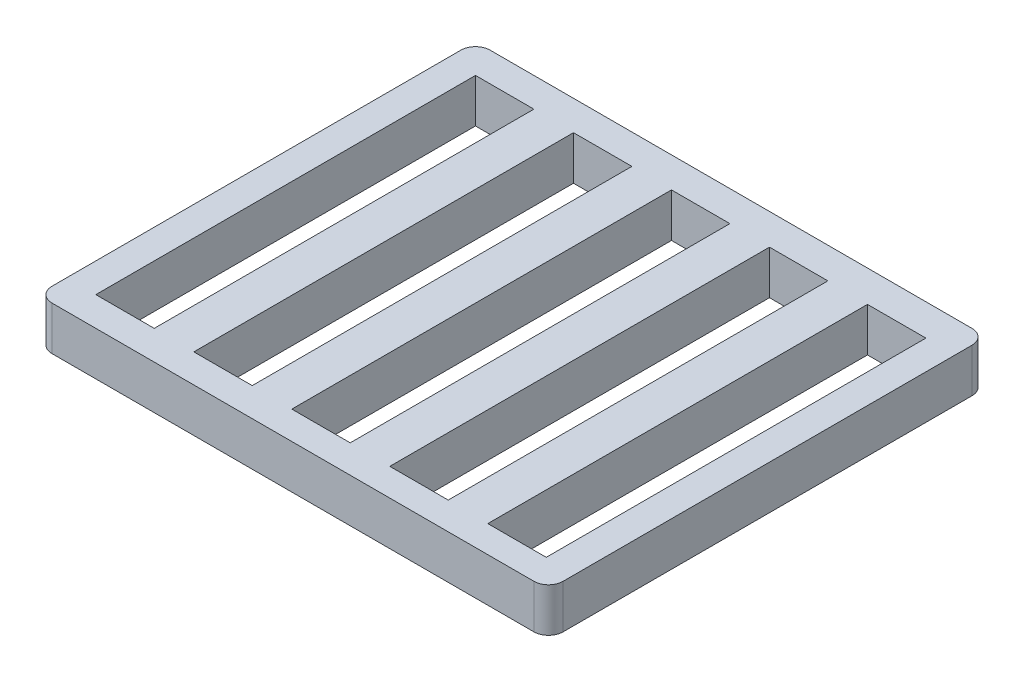
ISO-10303-21;
HEADER;
FILE_DESCRIPTION(('STEP AP214'),'2;1');
FILE_NAME('part.step','',(''),(''),'','','');
FILE_SCHEMA(('AUTOMOTIVE_DESIGN { 1 0 10303 214 1 1 1 1 }'));
ENDSEC;
DATA;
#1=APPLICATION_CONTEXT('core data for automotive mechanical design processes');
#2=APPLICATION_PROTOCOL_DEFINITION('international standard','automotive_design',2000,#1);
#3=PRODUCT_CONTEXT('',#1,'mechanical');
#4=PRODUCT('Part','Part','',(#3));
#5=PRODUCT_RELATED_PRODUCT_CATEGORY('part','',(#4));
#6=PRODUCT_DEFINITION_FORMATION('','',#4);
#7=PRODUCT_DEFINITION_CONTEXT('part definition',#1,'design');
#8=PRODUCT_DEFINITION('design','',#6,#7);
#9=PRODUCT_DEFINITION_SHAPE('','',#8);
#10=(LENGTH_UNIT() NAMED_UNIT(*) SI_UNIT(.MILLI.,.METRE.));
#11=(NAMED_UNIT(*) PLANE_ANGLE_UNIT() SI_UNIT($,.RADIAN.));
#12=(NAMED_UNIT(*) SI_UNIT($,.STERADIAN.) SOLID_ANGLE_UNIT());
#13=UNCERTAINTY_MEASURE_WITH_UNIT(LENGTH_MEASURE(1.E-05),#10,'distance_accuracy_value','');
#14=(GEOMETRIC_REPRESENTATION_CONTEXT(3) GLOBAL_UNCERTAINTY_ASSIGNED_CONTEXT((#13)) GLOBAL_UNIT_ASSIGNED_CONTEXT((#10,
#11,#12)) REPRESENTATION_CONTEXT('',''));
#15=CARTESIAN_POINT('',(0.,0.,0.));
#16=DIRECTION('',(0.,0.,1.));
#17=DIRECTION('',(1.,0.,0.));
#18=AXIS2_PLACEMENT_3D('',#15,#16,#17);
#19=CARTESIAN_POINT('',(0.,30.,300.));
#20=DIRECTION('',(0.,0.,-1.));
#21=DIRECTION('',(-1.,0.,0.));
#22=AXIS2_PLACEMENT_3D('',#19,#20,#21);
#23=PLANE('',#22);
#24=DIRECTION('',(1.,0.,0.));
#25=VECTOR('',#24,1.);
#26=CARTESIAN_POINT('',(0.,30.,300.));
#27=LINE('',#26,#25);
#28=CARTESIAN_POINT('',(10.,30.,300.));
#29=VERTEX_POINT('',#28);
#30=CARTESIAN_POINT('',(340.,30.,300.));
#31=VERTEX_POINT('',#30);
#32=EDGE_CURVE('E462',#29,#31,#27,.T.);
#33=ORIENTED_EDGE('',*,*,#32,.F.);
#34=DIRECTION('',(0.,-1.,0.));
#35=VECTOR('',#34,1.);
#36=CARTESIAN_POINT('',(10.,30.,300.));
#37=LINE('',#36,#35);
#38=CARTESIAN_POINT('',(10.,0.,300.));
#39=VERTEX_POINT('',#38);
#40=EDGE_CURVE('E531',#29,#39,#37,.T.);
#41=ORIENTED_EDGE('',*,*,#40,.T.);
#42=DIRECTION('',(1.,0.,0.));
#43=VECTOR('',#42,1.);
#44=CARTESIAN_POINT('',(0.,0.,300.));
#45=LINE('',#44,#43);
#46=CARTESIAN_POINT('',(340.,0.,300.));
#47=VERTEX_POINT('',#46);
#48=EDGE_CURVE('E281',#39,#47,#45,.T.);
#49=ORIENTED_EDGE('',*,*,#48,.T.);
#50=DIRECTION('',(0.,-1.,0.));
#51=VECTOR('',#50,1.);
#52=CARTESIAN_POINT('',(340.,30.,300.));
#53=LINE('',#52,#51);
#54=EDGE_CURVE('E528',#47,#31,#53,.F.);
#55=ORIENTED_EDGE('',*,*,#54,.T.);
#56=EDGE_LOOP('',(#33,#41,#49,#55));
#57=FACE_BOUND('',#56,.T.);
#58=ADVANCED_FACE('F43',(#57),#23,.F.);
#59=CARTESIAN_POINT('',(350.,30.,0.));
#60=DIRECTION('',(1.,0.,0.));
#61=DIRECTION('',(0.,0.,-1.));
#62=AXIS2_PLACEMENT_3D('',#59,#60,#61);
#63=PLANE('',#62);
#64=DIRECTION('',(0.,0.,1.));
#65=VECTOR('',#64,1.);
#66=CARTESIAN_POINT('',(350.,30.,0.));
#67=LINE('',#66,#65);
#68=CARTESIAN_POINT('',(350.,30.,10.));
#69=VERTEX_POINT('',#68);
#70=CARTESIAN_POINT('',(350.,30.,290.));
#71=VERTEX_POINT('',#70);
#72=EDGE_CURVE('E465',#69,#71,#67,.T.);
#73=ORIENTED_EDGE('',*,*,#72,.T.);
#74=DIRECTION('',(0.,-1.,0.));
#75=VECTOR('',#74,1.);
#76=CARTESIAN_POINT('',(350.,0.,290.));
#77=LINE('',#76,#75);
#78=CARTESIAN_POINT('',(350.,0.,290.));
#79=VERTEX_POINT('',#78);
#80=EDGE_CURVE('E11',#71,#79,#77,.T.);
#81=ORIENTED_EDGE('',*,*,#80,.T.);
#82=DIRECTION('',(0.,0.,1.));
#83=VECTOR('',#82,1.);
#84=CARTESIAN_POINT('',(350.,0.,0.));
#85=LINE('',#84,#83);
#86=CARTESIAN_POINT('',(350.,0.,10.));
#87=VERTEX_POINT('',#86);
#88=EDGE_CURVE('E481',#87,#79,#85,.T.);
#89=ORIENTED_EDGE('',*,*,#88,.F.);
#90=DIRECTION('',(0.,-1.,0.));
#91=VECTOR('',#90,1.);
#92=CARTESIAN_POINT('',(350.,30.,10.));
#93=LINE('',#92,#91);
#94=EDGE_CURVE('E52',#87,#69,#93,.F.);
#95=ORIENTED_EDGE('',*,*,#94,.T.);
#96=EDGE_LOOP('',(#73,#81,#89,#95));
#97=FACE_BOUND('',#96,.T.);
#98=ADVANCED_FACE('F548',(#97),#63,.T.);
#99=CARTESIAN_POINT('',(0.,30.,0.));
#100=DIRECTION('',(0.,0.,-1.));
#101=DIRECTION('',(-1.,0.,0.));
#102=AXIS2_PLACEMENT_3D('',#99,#100,#101);
#103=PLANE('',#102);
#104=DIRECTION('',(1.,0.,0.));
#105=VECTOR('',#104,1.);
#106=CARTESIAN_POINT('',(0.,0.,0.));
#107=LINE('',#106,#105);
#108=CARTESIAN_POINT('',(10.,0.,0.));
#109=VERTEX_POINT('',#108);
#110=CARTESIAN_POINT('',(340.,0.,0.));
#111=VERTEX_POINT('',#110);
#112=EDGE_CURVE('E485',#109,#111,#107,.T.);
#113=ORIENTED_EDGE('',*,*,#112,.F.);
#114=DIRECTION('',(0.,-1.,0.));
#115=VECTOR('',#114,1.);
#116=CARTESIAN_POINT('',(10.,30.,0.));
#117=LINE('',#116,#115);
#118=CARTESIAN_POINT('',(10.,30.,0.));
#119=VERTEX_POINT('',#118);
#120=EDGE_CURVE('E514',#109,#119,#117,.F.);
#121=ORIENTED_EDGE('',*,*,#120,.T.);
#122=DIRECTION('',(1.,0.,0.));
#123=VECTOR('',#122,1.);
#124=CARTESIAN_POINT('',(0.,30.,0.));
#125=LINE('',#124,#123);
#126=CARTESIAN_POINT('',(340.,30.,0.));
#127=VERTEX_POINT('',#126);
#128=EDGE_CURVE('E469',#119,#127,#125,.T.);
#129=ORIENTED_EDGE('',*,*,#128,.T.);
#130=DIRECTION('',(0.,-1.,0.));
#131=VECTOR('',#130,1.);
#132=CARTESIAN_POINT('',(340.,30.,0.));
#133=LINE('',#132,#131);
#134=EDGE_CURVE('E510',#127,#111,#133,.T.);
#135=ORIENTED_EDGE('',*,*,#134,.T.);
#136=EDGE_LOOP('',(#113,#121,#129,#135));
#137=FACE_BOUND('',#136,.T.);
#138=ADVANCED_FACE('F555',(#137),#103,.T.);
#139=CARTESIAN_POINT('',(0.,30.,0.));
#140=DIRECTION('',(1.,0.,0.));
#141=DIRECTION('',(0.,0.,-1.));
#142=AXIS2_PLACEMENT_3D('',#139,#140,#141);
#143=PLANE('',#142);
#144=DIRECTION('',(0.,0.,1.));
#145=VECTOR('',#144,1.);
#146=CARTESIAN_POINT('',(0.,30.,0.));
#147=LINE('',#146,#145);
#148=CARTESIAN_POINT('',(0.,30.,10.));
#149=VERTEX_POINT('',#148);
#150=CARTESIAN_POINT('',(0.,30.,290.));
#151=VERTEX_POINT('',#150);
#152=EDGE_CURVE('E473',#149,#151,#147,.T.);
#153=ORIENTED_EDGE('',*,*,#152,.F.);
#154=DIRECTION('',(0.,-1.,0.));
#155=VECTOR('',#154,1.);
#156=CARTESIAN_POINT('',(0.,0.,10.));
#157=LINE('',#156,#155);
#158=CARTESIAN_POINT('',(0.,0.,10.));
#159=VERTEX_POINT('',#158);
#160=EDGE_CURVE('E494',#149,#159,#157,.T.);
#161=ORIENTED_EDGE('',*,*,#160,.T.);
#162=DIRECTION('',(0.,0.,1.));
#163=VECTOR('',#162,1.);
#164=CARTESIAN_POINT('',(0.,0.,0.));
#165=LINE('',#164,#163);
#166=CARTESIAN_POINT('',(0.,0.,290.));
#167=VERTEX_POINT('',#166);
#168=EDGE_CURVE('E466',#159,#167,#165,.T.);
#169=ORIENTED_EDGE('',*,*,#168,.T.);
#170=DIRECTION('',(0.,-1.,0.));
#171=VECTOR('',#170,1.);
#172=CARTESIAN_POINT('',(0.,30.,290.));
#173=LINE('',#172,#171);
#174=EDGE_CURVE('E477',#167,#151,#173,.F.);
#175=ORIENTED_EDGE('',*,*,#174,.T.);
#176=EDGE_LOOP('',(#153,#161,#169,#175));
#177=FACE_BOUND('',#176,.T.);
#178=ADVANCED_FACE('F563',(#177),#143,.F.);
#179=CARTESIAN_POINT('',(0.,30.,0.));
#180=DIRECTION('',(0.,-1.,0.));
#181=DIRECTION('',(0.,0.,-1.));
#182=AXIS2_PLACEMENT_3D('',#179,#180,#181);
#183=PLANE('',#182);
#184=DIRECTION('',(1.,0.,0.));
#185=VECTOR('',#184,1.);
#186=CARTESIAN_POINT('',(60.,30.,20.));
#187=LINE('',#186,#185);
#188=CARTESIAN_POINT('',(20.,30.,20.));
#189=VERTEX_POINT('',#188);
#190=CARTESIAN_POINT('',(60.,30.,20.));
#191=VERTEX_POINT('',#190);
#192=EDGE_CURVE('E243',#189,#191,#187,.T.);
#193=ORIENTED_EDGE('',*,*,#192,.T.);
#194=DIRECTION('',(0.,0.,1.));
#195=VECTOR('',#194,1.);
#196=CARTESIAN_POINT('',(60.,30.,20.));
#197=LINE('',#196,#195);
#198=CARTESIAN_POINT('',(60.,30.,280.));
#199=VERTEX_POINT('',#198);
#200=EDGE_CURVE('E234',#191,#199,#197,.T.);
#201=ORIENTED_EDGE('',*,*,#200,.T.);
#202=DIRECTION('',(-1.,0.,0.));
#203=VECTOR('',#202,1.);
#204=CARTESIAN_POINT('',(60.,30.,280.));
#205=LINE('',#204,#203);
#206=CARTESIAN_POINT('',(20.,30.,280.));
#207=VERTEX_POINT('',#206);
#208=EDGE_CURVE('E247',#199,#207,#205,.T.);
#209=ORIENTED_EDGE('',*,*,#208,.T.);
#210=DIRECTION('',(0.,0.,-1.));
#211=VECTOR('',#210,1.);
#212=CARTESIAN_POINT('',(20.,30.,20.));
#213=LINE('',#212,#211);
#214=EDGE_CURVE('E252',#207,#189,#213,.T.);
#215=ORIENTED_EDGE('',*,*,#214,.T.);
#216=EDGE_LOOP('',(#193,#201,#209,#215));
#217=FACE_BOUND('',#216,.T.);
#218=DIRECTION('',(0.,0.,-1.));
#219=VECTOR('',#218,1.);
#220=CARTESIAN_POINT('',(87.5,30.,20.3913207061418));
#221=LINE('',#220,#219);
#222=CARTESIAN_POINT('',(87.5,30.,280.391320706142));
#223=VERTEX_POINT('',#222);
#224=CARTESIAN_POINT('',(87.5,30.,20.3913207061418));
#225=VERTEX_POINT('',#224);
#226=EDGE_CURVE('E291',#223,#225,#221,.T.);
#227=ORIENTED_EDGE('',*,*,#226,.T.);
#228=DIRECTION('',(1.,0.,0.));
#229=VECTOR('',#228,1.);
#230=CARTESIAN_POINT('',(127.5,30.,20.3913207061418));
#231=LINE('',#230,#229);
#232=CARTESIAN_POINT('',(127.5,30.,20.3913207061418));
#233=VERTEX_POINT('',#232);
#234=EDGE_CURVE('E307',#225,#233,#231,.T.);
#235=ORIENTED_EDGE('',*,*,#234,.T.);
#236=DIRECTION('',(0.,0.,1.));
#237=VECTOR('',#236,1.);
#238=CARTESIAN_POINT('',(127.5,30.,20.3913207061418));
#239=LINE('',#238,#237);
#240=CARTESIAN_POINT('',(127.5,30.,280.391320706142));
#241=VERTEX_POINT('',#240);
#242=EDGE_CURVE('E324',#233,#241,#239,.T.);
#243=ORIENTED_EDGE('',*,*,#242,.T.);
#244=DIRECTION('',(-1.,0.,0.));
#245=VECTOR('',#244,1.);
#246=CARTESIAN_POINT('',(127.5,30.,280.391320706142));
#247=LINE('',#246,#245);
#248=EDGE_CURVE('E320',#241,#223,#247,.T.);
#249=ORIENTED_EDGE('',*,*,#248,.T.);
#250=EDGE_LOOP('',(#227,#235,#243,#249));
#251=FACE_BOUND('',#250,.T.);
#252=DIRECTION('',(0.,0.,-1.));
#253=VECTOR('',#252,1.);
#254=CARTESIAN_POINT('',(155.,30.,20.7826414122837));
#255=LINE('',#254,#253);
#256=CARTESIAN_POINT('',(155.,30.,280.782641412284));
#257=VERTEX_POINT('',#256);
#258=CARTESIAN_POINT('',(155.,30.,20.7826414122837));
#259=VERTEX_POINT('',#258);
#260=EDGE_CURVE('E335',#257,#259,#255,.T.);
#261=ORIENTED_EDGE('',*,*,#260,.T.);
#262=DIRECTION('',(1.,0.,0.));
#263=VECTOR('',#262,1.);
#264=CARTESIAN_POINT('',(195.,30.,20.7826414122837));
#265=LINE('',#264,#263);
#266=CARTESIAN_POINT('',(195.,30.,20.7826414122837));
#267=VERTEX_POINT('',#266);
#268=EDGE_CURVE('E351',#259,#267,#265,.T.);
#269=ORIENTED_EDGE('',*,*,#268,.T.);
#270=DIRECTION('',(0.,0.,1.));
#271=VECTOR('',#270,1.);
#272=CARTESIAN_POINT('',(195.,30.,20.7826414122837));
#273=LINE('',#272,#271);
#274=CARTESIAN_POINT('',(195.,30.,280.782641412284));
#275=VERTEX_POINT('',#274);
#276=EDGE_CURVE('E368',#267,#275,#273,.T.);
#277=ORIENTED_EDGE('',*,*,#276,.T.);
#278=DIRECTION('',(-1.,0.,0.));
#279=VECTOR('',#278,1.);
#280=CARTESIAN_POINT('',(195.,30.,280.782641412284));
#281=LINE('',#280,#279);
#282=EDGE_CURVE('E364',#275,#257,#281,.T.);
#283=ORIENTED_EDGE('',*,*,#282,.T.);
#284=EDGE_LOOP('',(#261,#269,#277,#283));
#285=FACE_BOUND('',#284,.T.);
#286=DIRECTION('',(0.,0.,-1.));
#287=VECTOR('',#286,1.);
#288=CARTESIAN_POINT('',(222.5,30.,21.1739621184255));
#289=LINE('',#288,#287);
#290=CARTESIAN_POINT('',(222.5,30.,281.173962118425));
#291=VERTEX_POINT('',#290);
#292=CARTESIAN_POINT('',(222.5,30.,21.1739621184255));
#293=VERTEX_POINT('',#292);
#294=EDGE_CURVE('E379',#291,#293,#289,.T.);
#295=ORIENTED_EDGE('',*,*,#294,.T.);
#296=DIRECTION('',(1.,0.,0.));
#297=VECTOR('',#296,1.);
#298=CARTESIAN_POINT('',(262.5,30.,21.1739621184255));
#299=LINE('',#298,#297);
#300=CARTESIAN_POINT('',(262.5,30.,21.1739621184255));
#301=VERTEX_POINT('',#300);
#302=EDGE_CURVE('E395',#293,#301,#299,.T.);
#303=ORIENTED_EDGE('',*,*,#302,.T.);
#304=DIRECTION('',(0.,0.,1.));
#305=VECTOR('',#304,1.);
#306=CARTESIAN_POINT('',(262.5,30.,21.1739621184255));
#307=LINE('',#306,#305);
#308=CARTESIAN_POINT('',(262.5,30.,281.173962118425));
#309=VERTEX_POINT('',#308);
#310=EDGE_CURVE('E412',#301,#309,#307,.T.);
#311=ORIENTED_EDGE('',*,*,#310,.T.);
#312=DIRECTION('',(-1.,0.,0.));
#313=VECTOR('',#312,1.);
#314=CARTESIAN_POINT('',(262.5,30.,281.173962118425));
#315=LINE('',#314,#313);
#316=EDGE_CURVE('E408',#309,#291,#315,.T.);
#317=ORIENTED_EDGE('',*,*,#316,.T.);
#318=EDGE_LOOP('',(#295,#303,#311,#317));
#319=FACE_BOUND('',#318,.T.);
#320=DIRECTION('',(0.,0.,-1.));
#321=VECTOR('',#320,1.);
#322=CARTESIAN_POINT('',(290.,30.,21.5652828245673));
#323=LINE('',#322,#321);
#324=CARTESIAN_POINT('',(290.,30.,281.565282824567));
#325=VERTEX_POINT('',#324);
#326=CARTESIAN_POINT('',(290.,30.,21.5652828245673));
#327=VERTEX_POINT('',#326);
#328=EDGE_CURVE('E423',#325,#327,#323,.T.);
#329=ORIENTED_EDGE('',*,*,#328,.T.);
#330=DIRECTION('',(1.,0.,0.));
#331=VECTOR('',#330,1.);
#332=CARTESIAN_POINT('',(330.,30.,21.5652828245673));
#333=LINE('',#332,#331);
#334=CARTESIAN_POINT('',(330.,30.,21.5652828245673));
#335=VERTEX_POINT('',#334);
#336=EDGE_CURVE('E438',#327,#335,#333,.T.);
#337=ORIENTED_EDGE('',*,*,#336,.T.);
#338=DIRECTION('',(0.,0.,1.));
#339=VECTOR('',#338,1.);
#340=CARTESIAN_POINT('',(330.,30.,21.5652828245673));
#341=LINE('',#340,#339);
#342=CARTESIAN_POINT('',(330.,30.,281.565282824567));
#343=VERTEX_POINT('',#342);
#344=EDGE_CURVE('E455',#335,#343,#341,.T.);
#345=ORIENTED_EDGE('',*,*,#344,.T.);
#346=DIRECTION('',(-1.,0.,0.));
#347=VECTOR('',#346,1.);
#348=CARTESIAN_POINT('',(330.,30.,281.565282824567));
#349=LINE('',#348,#347);
#350=EDGE_CURVE('E451',#343,#325,#349,.T.);
#351=ORIENTED_EDGE('',*,*,#350,.T.);
#352=EDGE_LOOP('',(#329,#337,#345,#351));
#353=FACE_BOUND('',#352,.T.);
#354=ORIENTED_EDGE('',*,*,#128,.F.);
#355=CARTESIAN_POINT('',(10.,30.,10.));
#356=DIRECTION('',(0.,-1.,0.));
#357=DIRECTION('',(0.,0.,-1.));
#358=AXIS2_PLACEMENT_3D('',#355,#356,#357);
#359=CIRCLE('',#358,10.);
#360=EDGE_CURVE('E525',#119,#149,#359,.F.);
#361=ORIENTED_EDGE('',*,*,#360,.T.);
#362=ORIENTED_EDGE('',*,*,#152,.T.);
#363=CARTESIAN_POINT('',(10.,30.,290.));
#364=DIRECTION('',(0.,-1.,0.));
#365=DIRECTION('',(0.,0.,-1.));
#366=AXIS2_PLACEMENT_3D('',#363,#364,#365);
#367=CIRCLE('',#366,10.);
#368=EDGE_CURVE('E522',#151,#29,#367,.F.);
#369=ORIENTED_EDGE('',*,*,#368,.T.);
#370=ORIENTED_EDGE('',*,*,#32,.T.);
#371=CARTESIAN_POINT('',(340.,30.,290.));
#372=DIRECTION('',(0.,-1.,0.));
#373=DIRECTION('',(0.,0.,-1.));
#374=AXIS2_PLACEMENT_3D('',#371,#372,#373);
#375=CIRCLE('',#374,10.);
#376=EDGE_CURVE('E59',#31,#71,#375,.F.);
#377=ORIENTED_EDGE('',*,*,#376,.T.);
#378=ORIENTED_EDGE('',*,*,#72,.F.);
#379=CARTESIAN_POINT('',(340.,30.,10.));
#380=DIRECTION('',(0.,-1.,0.));
#381=DIRECTION('',(0.,0.,-1.));
#382=AXIS2_PLACEMENT_3D('',#379,#380,#381);
#383=CIRCLE('',#382,10.);
#384=EDGE_CURVE('E517',#69,#127,#383,.F.);
#385=ORIENTED_EDGE('',*,*,#384,.T.);
#386=EDGE_LOOP('',(#354,#361,#362,#369,#370,#377,#378,#385));
#387=FACE_BOUND('',#386,.T.);
#388=ADVANCED_FACE('F254',(#217,#251,#285,#319,#353,#387),#183,.F.);
#389=CARTESIAN_POINT('',(0.,0.,0.));
#390=DIRECTION('',(0.,-1.,0.));
#391=DIRECTION('',(0.,0.,-1.));
#392=AXIS2_PLACEMENT_3D('',#389,#390,#391);
#393=PLANE('',#392);
#394=DIRECTION('',(0.,0.,1.));
#395=VECTOR('',#394,1.);
#396=CARTESIAN_POINT('',(60.,0.,20.));
#397=LINE('',#396,#395);
#398=CARTESIAN_POINT('',(60.,0.,20.));
#399=VERTEX_POINT('',#398);
#400=CARTESIAN_POINT('',(60.,0.,280.));
#401=VERTEX_POINT('',#400);
#402=EDGE_CURVE('E237',#399,#401,#397,.T.);
#403=ORIENTED_EDGE('',*,*,#402,.F.);
#404=DIRECTION('',(1.,0.,0.));
#405=VECTOR('',#404,1.);
#406=CARTESIAN_POINT('',(60.,0.,20.));
#407=LINE('',#406,#405);
#408=CARTESIAN_POINT('',(20.,0.,20.));
#409=VERTEX_POINT('',#408);
#410=EDGE_CURVE('E258',#409,#399,#407,.T.);
#411=ORIENTED_EDGE('',*,*,#410,.F.);
#412=DIRECTION('',(0.,0.,-1.));
#413=VECTOR('',#412,1.);
#414=CARTESIAN_POINT('',(20.,0.,20.));
#415=LINE('',#414,#413);
#416=CARTESIAN_POINT('',(20.,0.,280.));
#417=VERTEX_POINT('',#416);
#418=EDGE_CURVE('E262',#417,#409,#415,.T.);
#419=ORIENTED_EDGE('',*,*,#418,.F.);
#420=DIRECTION('',(-1.,0.,0.));
#421=VECTOR('',#420,1.);
#422=CARTESIAN_POINT('',(60.,0.,280.));
#423=LINE('',#422,#421);
#424=EDGE_CURVE('E271',#401,#417,#423,.T.);
#425=ORIENTED_EDGE('',*,*,#424,.F.);
#426=EDGE_LOOP('',(#403,#411,#419,#425));
#427=FACE_BOUND('',#426,.T.);
#428=DIRECTION('',(1.,0.,0.));
#429=VECTOR('',#428,1.);
#430=CARTESIAN_POINT('',(127.5,0.,20.3913207061418));
#431=LINE('',#430,#429);
#432=CARTESIAN_POINT('',(87.5,0.,20.3913207061418));
#433=VERTEX_POINT('',#432);
#434=CARTESIAN_POINT('',(127.5,0.,20.3913207061418));
#435=VERTEX_POINT('',#434);
#436=EDGE_CURVE('E272',#433,#435,#431,.T.);
#437=ORIENTED_EDGE('',*,*,#436,.F.);
#438=DIRECTION('',(0.,0.,-1.));
#439=VECTOR('',#438,1.);
#440=CARTESIAN_POINT('',(87.5,0.,20.3913207061418));
#441=LINE('',#440,#439);
#442=CARTESIAN_POINT('',(87.5,0.,280.391320706142));
#443=VERTEX_POINT('',#442);
#444=EDGE_CURVE('E302',#443,#433,#441,.T.);
#445=ORIENTED_EDGE('',*,*,#444,.F.);
#446=DIRECTION('',(-1.,0.,0.));
#447=VECTOR('',#446,1.);
#448=CARTESIAN_POINT('',(127.5,0.,280.391320706142));
#449=LINE('',#448,#447);
#450=CARTESIAN_POINT('',(127.5,0.,280.391320706142));
#451=VERTEX_POINT('',#450);
#452=EDGE_CURVE('E306',#451,#443,#449,.T.);
#453=ORIENTED_EDGE('',*,*,#452,.F.);
#454=DIRECTION('',(0.,0.,1.));
#455=VECTOR('',#454,1.);
#456=CARTESIAN_POINT('',(127.5,0.,20.3913207061418));
#457=LINE('',#456,#455);
#458=EDGE_CURVE('E311',#435,#451,#457,.T.);
#459=ORIENTED_EDGE('',*,*,#458,.F.);
#460=EDGE_LOOP('',(#437,#445,#453,#459));
#461=FACE_BOUND('',#460,.T.);
#462=DIRECTION('',(1.,0.,0.));
#463=VECTOR('',#462,1.);
#464=CARTESIAN_POINT('',(195.,0.,20.7826414122837));
#465=LINE('',#464,#463);
#466=CARTESIAN_POINT('',(155.,0.,20.7826414122837));
#467=VERTEX_POINT('',#466);
#468=CARTESIAN_POINT('',(195.,0.,20.7826414122837));
#469=VERTEX_POINT('',#468);
#470=EDGE_CURVE('E301',#467,#469,#465,.T.);
#471=ORIENTED_EDGE('',*,*,#470,.F.);
#472=DIRECTION('',(0.,0.,-1.));
#473=VECTOR('',#472,1.);
#474=CARTESIAN_POINT('',(155.,0.,20.7826414122837));
#475=LINE('',#474,#473);
#476=CARTESIAN_POINT('',(155.,0.,280.782641412284));
#477=VERTEX_POINT('',#476);
#478=EDGE_CURVE('E346',#477,#467,#475,.T.);
#479=ORIENTED_EDGE('',*,*,#478,.F.);
#480=DIRECTION('',(-1.,0.,0.));
#481=VECTOR('',#480,1.);
#482=CARTESIAN_POINT('',(195.,0.,280.782641412284));
#483=LINE('',#482,#481);
#484=CARTESIAN_POINT('',(195.,0.,280.782641412284));
#485=VERTEX_POINT('',#484);
#486=EDGE_CURVE('E350',#485,#477,#483,.T.);
#487=ORIENTED_EDGE('',*,*,#486,.F.);
#488=DIRECTION('',(0.,0.,1.));
#489=VECTOR('',#488,1.);
#490=CARTESIAN_POINT('',(195.,0.,20.7826414122837));
#491=LINE('',#490,#489);
#492=EDGE_CURVE('E355',#469,#485,#491,.T.);
#493=ORIENTED_EDGE('',*,*,#492,.F.);
#494=EDGE_LOOP('',(#471,#479,#487,#493));
#495=FACE_BOUND('',#494,.T.);
#496=DIRECTION('',(1.,0.,0.));
#497=VECTOR('',#496,1.);
#498=CARTESIAN_POINT('',(262.5,0.,21.1739621184255));
#499=LINE('',#498,#497);
#500=CARTESIAN_POINT('',(222.5,0.,21.1739621184255));
#501=VERTEX_POINT('',#500);
#502=CARTESIAN_POINT('',(262.5,0.,21.1739621184255));
#503=VERTEX_POINT('',#502);
#504=EDGE_CURVE('E345',#501,#503,#499,.T.);
#505=ORIENTED_EDGE('',*,*,#504,.F.);
#506=DIRECTION('',(0.,0.,-1.));
#507=VECTOR('',#506,1.);
#508=CARTESIAN_POINT('',(222.5,0.,21.1739621184255));
#509=LINE('',#508,#507);
#510=CARTESIAN_POINT('',(222.5,0.,281.173962118425));
#511=VERTEX_POINT('',#510);
#512=EDGE_CURVE('E390',#511,#501,#509,.T.);
#513=ORIENTED_EDGE('',*,*,#512,.F.);
#514=DIRECTION('',(-1.,0.,0.));
#515=VECTOR('',#514,1.);
#516=CARTESIAN_POINT('',(262.5,0.,281.173962118425));
#517=LINE('',#516,#515);
#518=CARTESIAN_POINT('',(262.5,0.,281.173962118425));
#519=VERTEX_POINT('',#518);
#520=EDGE_CURVE('E394',#519,#511,#517,.T.);
#521=ORIENTED_EDGE('',*,*,#520,.F.);
#522=DIRECTION('',(0.,0.,1.));
#523=VECTOR('',#522,1.);
#524=CARTESIAN_POINT('',(262.5,0.,21.1739621184255));
#525=LINE('',#524,#523);
#526=EDGE_CURVE('E399',#503,#519,#525,.T.);
#527=ORIENTED_EDGE('',*,*,#526,.F.);
#528=EDGE_LOOP('',(#505,#513,#521,#527));
#529=FACE_BOUND('',#528,.T.);
#530=DIRECTION('',(1.,0.,0.));
#531=VECTOR('',#530,1.);
#532=CARTESIAN_POINT('',(330.,0.,21.5652828245673));
#533=LINE('',#532,#531);
#534=CARTESIAN_POINT('',(290.,0.,21.5652828245673));
#535=VERTEX_POINT('',#534);
#536=CARTESIAN_POINT('',(330.,0.,21.5652828245673));
#537=VERTEX_POINT('',#536);
#538=EDGE_CURVE('E389',#535,#537,#533,.T.);
#539=ORIENTED_EDGE('',*,*,#538,.F.);
#540=DIRECTION('',(0.,0.,-1.));
#541=VECTOR('',#540,1.);
#542=CARTESIAN_POINT('',(290.,0.,21.5652828245673));
#543=LINE('',#542,#541);
#544=CARTESIAN_POINT('',(290.,0.,281.565282824567));
#545=VERTEX_POINT('',#544);
#546=EDGE_CURVE('E433',#545,#535,#543,.T.);
#547=ORIENTED_EDGE('',*,*,#546,.F.);
#548=DIRECTION('',(-1.,0.,0.));
#549=VECTOR('',#548,1.);
#550=CARTESIAN_POINT('',(330.,0.,281.565282824567));
#551=LINE('',#550,#549);
#552=CARTESIAN_POINT('',(330.,0.,281.565282824567));
#553=VERTEX_POINT('',#552);
#554=EDGE_CURVE('E437',#553,#545,#551,.T.);
#555=ORIENTED_EDGE('',*,*,#554,.F.);
#556=DIRECTION('',(0.,0.,1.));
#557=VECTOR('',#556,1.);
#558=CARTESIAN_POINT('',(330.,0.,21.5652828245673));
#559=LINE('',#558,#557);
#560=EDGE_CURVE('E442',#537,#553,#559,.T.);
#561=ORIENTED_EDGE('',*,*,#560,.F.);
#562=EDGE_LOOP('',(#539,#547,#555,#561));
#563=FACE_BOUND('',#562,.T.);
#564=ORIENTED_EDGE('',*,*,#168,.F.);
#565=CARTESIAN_POINT('',(10.,0.,10.));
#566=DIRECTION('',(0.,-1.,0.));
#567=DIRECTION('',(0.,0.,-1.));
#568=AXIS2_PLACEMENT_3D('',#565,#566,#567);
#569=CIRCLE('',#568,10.);
#570=EDGE_CURVE('E507',#159,#109,#569,.T.);
#571=ORIENTED_EDGE('',*,*,#570,.T.);
#572=ORIENTED_EDGE('',*,*,#112,.T.);
#573=CARTESIAN_POINT('',(340.,0.,10.));
#574=DIRECTION('',(0.,-1.,0.));
#575=DIRECTION('',(0.,0.,-1.));
#576=AXIS2_PLACEMENT_3D('',#573,#574,#575);
#577=CIRCLE('',#576,10.);
#578=EDGE_CURVE('E498',#111,#87,#577,.T.);
#579=ORIENTED_EDGE('',*,*,#578,.T.);
#580=ORIENTED_EDGE('',*,*,#88,.T.);
#581=CARTESIAN_POINT('',(340.,0.,290.));
#582=DIRECTION('',(0.,-1.,0.));
#583=DIRECTION('',(0.,0.,-1.));
#584=AXIS2_PLACEMENT_3D('',#581,#582,#583);
#585=CIRCLE('',#584,10.);
#586=EDGE_CURVE('E501',#79,#47,#585,.T.);
#587=ORIENTED_EDGE('',*,*,#586,.T.);
#588=ORIENTED_EDGE('',*,*,#48,.F.);
#589=CARTESIAN_POINT('',(10.,0.,290.));
#590=DIRECTION('',(0.,-1.,0.));
#591=DIRECTION('',(0.,0.,-1.));
#592=AXIS2_PLACEMENT_3D('',#589,#590,#591);
#593=CIRCLE('',#592,10.);
#594=EDGE_CURVE('E504',#39,#167,#593,.T.);
#595=ORIENTED_EDGE('',*,*,#594,.T.);
#596=EDGE_LOOP('',(#564,#571,#572,#579,#580,#587,#588,#595));
#597=FACE_BOUND('',#596,.T.);
#598=ADVANCED_FACE('F544',(#427,#461,#495,#529,#563,#597),#393,.T.);
#599=CARTESIAN_POINT('',(330.,30.,21.5652828245673));
#600=DIRECTION('',(0.,0.,-1.));
#601=DIRECTION('',(-1.,0.,0.));
#602=AXIS2_PLACEMENT_3D('',#599,#600,#601);
#603=PLANE('',#602);
#604=ORIENTED_EDGE('',*,*,#538,.T.);
#605=DIRECTION('',(0.,-1.,0.));
#606=VECTOR('',#605,1.);
#607=CARTESIAN_POINT('',(330.,30.,21.5652828245673));
#608=LINE('',#607,#606);
#609=EDGE_CURVE('E419',#335,#537,#608,.T.);
#610=ORIENTED_EDGE('',*,*,#609,.F.);
#611=ORIENTED_EDGE('',*,*,#336,.F.);
#612=DIRECTION('',(0.,-1.,0.));
#613=VECTOR('',#612,1.);
#614=CARTESIAN_POINT('',(290.,30.,21.5652828245673));
#615=LINE('',#614,#613);
#616=EDGE_CURVE('E430',#327,#535,#615,.T.);
#617=ORIENTED_EDGE('',*,*,#616,.T.);
#618=EDGE_LOOP('',(#604,#610,#611,#617));
#619=FACE_BOUND('',#618,.T.);
#620=ADVANCED_FACE('F586',(#619),#603,.F.);
#621=CARTESIAN_POINT('',(290.,30.,21.5652828245673));
#622=DIRECTION('',(-1.,0.,0.));
#623=DIRECTION('',(0.,0.,1.));
#624=AXIS2_PLACEMENT_3D('',#621,#622,#623);
#625=PLANE('',#624);
#626=ORIENTED_EDGE('',*,*,#546,.T.);
#627=ORIENTED_EDGE('',*,*,#616,.F.);
#628=ORIENTED_EDGE('',*,*,#328,.F.);
#629=DIRECTION('',(0.,-1.,0.));
#630=VECTOR('',#629,1.);
#631=CARTESIAN_POINT('',(290.,30.,281.565282824567));
#632=LINE('',#631,#630);
#633=EDGE_CURVE('E427',#325,#545,#632,.T.);
#634=ORIENTED_EDGE('',*,*,#633,.T.);
#635=EDGE_LOOP('',(#626,#627,#628,#634));
#636=FACE_BOUND('',#635,.T.);
#637=ADVANCED_FACE('F590',(#636),#625,.F.);
#638=CARTESIAN_POINT('',(330.,30.,281.565282824567));
#639=DIRECTION('',(0.,0.,1.));
#640=DIRECTION('',(1.,0.,0.));
#641=AXIS2_PLACEMENT_3D('',#638,#639,#640);
#642=PLANE('',#641);
#643=ORIENTED_EDGE('',*,*,#554,.T.);
#644=ORIENTED_EDGE('',*,*,#633,.F.);
#645=ORIENTED_EDGE('',*,*,#350,.F.);
#646=DIRECTION('',(0.,-1.,0.));
#647=VECTOR('',#646,1.);
#648=CARTESIAN_POINT('',(330.,30.,281.565282824567));
#649=LINE('',#648,#647);
#650=EDGE_CURVE('E424',#343,#553,#649,.T.);
#651=ORIENTED_EDGE('',*,*,#650,.T.);
#652=EDGE_LOOP('',(#643,#644,#645,#651));
#653=FACE_BOUND('',#652,.T.);
#654=ADVANCED_FACE('F593',(#653),#642,.F.);
#655=CARTESIAN_POINT('',(330.,30.,21.5652828245673));
#656=DIRECTION('',(1.,0.,0.));
#657=DIRECTION('',(0.,0.,-1.));
#658=AXIS2_PLACEMENT_3D('',#655,#656,#657);
#659=PLANE('',#658);
#660=ORIENTED_EDGE('',*,*,#560,.T.);
#661=ORIENTED_EDGE('',*,*,#650,.F.);
#662=ORIENTED_EDGE('',*,*,#344,.F.);
#663=ORIENTED_EDGE('',*,*,#609,.T.);
#664=EDGE_LOOP('',(#660,#661,#662,#663));
#665=FACE_BOUND('',#664,.T.);
#666=ADVANCED_FACE('F597',(#665),#659,.F.);
#667=CARTESIAN_POINT('',(262.5,30.,21.1739621184255));
#668=DIRECTION('',(0.,0.,-1.));
#669=DIRECTION('',(-1.,0.,0.));
#670=AXIS2_PLACEMENT_3D('',#667,#668,#669);
#671=PLANE('',#670);
#672=ORIENTED_EDGE('',*,*,#504,.T.);
#673=DIRECTION('',(0.,-1.,0.));
#674=VECTOR('',#673,1.);
#675=CARTESIAN_POINT('',(262.5,30.,21.1739621184255));
#676=LINE('',#675,#674);
#677=EDGE_CURVE('E375',#301,#503,#676,.T.);
#678=ORIENTED_EDGE('',*,*,#677,.F.);
#679=ORIENTED_EDGE('',*,*,#302,.F.);
#680=DIRECTION('',(0.,-1.,0.));
#681=VECTOR('',#680,1.);
#682=CARTESIAN_POINT('',(222.5,30.,21.1739621184255));
#683=LINE('',#682,#681);
#684=EDGE_CURVE('E386',#293,#501,#683,.T.);
#685=ORIENTED_EDGE('',*,*,#684,.T.);
#686=EDGE_LOOP('',(#672,#678,#679,#685));
#687=FACE_BOUND('',#686,.T.);
#688=ADVANCED_FACE('F601',(#687),#671,.F.);
#689=CARTESIAN_POINT('',(222.5,30.,21.1739621184255));
#690=DIRECTION('',(-1.,0.,0.));
#691=DIRECTION('',(0.,0.,1.));
#692=AXIS2_PLACEMENT_3D('',#689,#690,#691);
#693=PLANE('',#692);
#694=ORIENTED_EDGE('',*,*,#512,.T.);
#695=ORIENTED_EDGE('',*,*,#684,.F.);
#696=ORIENTED_EDGE('',*,*,#294,.F.);
#697=DIRECTION('',(0.,-1.,0.));
#698=VECTOR('',#697,1.);
#699=CARTESIAN_POINT('',(222.5,30.,281.173962118425));
#700=LINE('',#699,#698);
#701=EDGE_CURVE('E383',#291,#511,#700,.T.);
#702=ORIENTED_EDGE('',*,*,#701,.T.);
#703=EDGE_LOOP('',(#694,#695,#696,#702));
#704=FACE_BOUND('',#703,.T.);
#705=ADVANCED_FACE('F606',(#704),#693,.F.);
#706=CARTESIAN_POINT('',(262.5,30.,281.173962118425));
#707=DIRECTION('',(0.,0.,1.));
#708=DIRECTION('',(1.,0.,0.));
#709=AXIS2_PLACEMENT_3D('',#706,#707,#708);
#710=PLANE('',#709);
#711=ORIENTED_EDGE('',*,*,#520,.T.);
#712=ORIENTED_EDGE('',*,*,#701,.F.);
#713=ORIENTED_EDGE('',*,*,#316,.F.);
#714=DIRECTION('',(0.,-1.,0.));
#715=VECTOR('',#714,1.);
#716=CARTESIAN_POINT('',(262.5,30.,281.173962118425));
#717=LINE('',#716,#715);
#718=EDGE_CURVE('E380',#309,#519,#717,.T.);
#719=ORIENTED_EDGE('',*,*,#718,.T.);
#720=EDGE_LOOP('',(#711,#712,#713,#719));
#721=FACE_BOUND('',#720,.T.);
#722=ADVANCED_FACE('F609',(#721),#710,.F.);
#723=CARTESIAN_POINT('',(262.5,30.,21.1739621184255));
#724=DIRECTION('',(1.,0.,0.));
#725=DIRECTION('',(0.,0.,-1.));
#726=AXIS2_PLACEMENT_3D('',#723,#724,#725);
#727=PLANE('',#726);
#728=ORIENTED_EDGE('',*,*,#526,.T.);
#729=ORIENTED_EDGE('',*,*,#718,.F.);
#730=ORIENTED_EDGE('',*,*,#310,.F.);
#731=ORIENTED_EDGE('',*,*,#677,.T.);
#732=EDGE_LOOP('',(#728,#729,#730,#731));
#733=FACE_BOUND('',#732,.T.);
#734=ADVANCED_FACE('F613',(#733),#727,.F.);
#735=CARTESIAN_POINT('',(195.,30.,20.7826414122837));
#736=DIRECTION('',(0.,0.,-1.));
#737=DIRECTION('',(-1.,0.,0.));
#738=AXIS2_PLACEMENT_3D('',#735,#736,#737);
#739=PLANE('',#738);
#740=ORIENTED_EDGE('',*,*,#470,.T.);
#741=DIRECTION('',(0.,-1.,0.));
#742=VECTOR('',#741,1.);
#743=CARTESIAN_POINT('',(195.,30.,20.7826414122837));
#744=LINE('',#743,#742);
#745=EDGE_CURVE('E331',#267,#469,#744,.T.);
#746=ORIENTED_EDGE('',*,*,#745,.F.);
#747=ORIENTED_EDGE('',*,*,#268,.F.);
#748=DIRECTION('',(0.,-1.,0.));
#749=VECTOR('',#748,1.);
#750=CARTESIAN_POINT('',(155.,30.,20.7826414122837));
#751=LINE('',#750,#749);
#752=EDGE_CURVE('E342',#259,#467,#751,.T.);
#753=ORIENTED_EDGE('',*,*,#752,.T.);
#754=EDGE_LOOP('',(#740,#746,#747,#753));
#755=FACE_BOUND('',#754,.T.);
#756=ADVANCED_FACE('F617',(#755),#739,.F.);
#757=CARTESIAN_POINT('',(155.,30.,20.7826414122837));
#758=DIRECTION('',(-1.,0.,0.));
#759=DIRECTION('',(0.,0.,1.));
#760=AXIS2_PLACEMENT_3D('',#757,#758,#759);
#761=PLANE('',#760);
#762=ORIENTED_EDGE('',*,*,#478,.T.);
#763=ORIENTED_EDGE('',*,*,#752,.F.);
#764=ORIENTED_EDGE('',*,*,#260,.F.);
#765=DIRECTION('',(0.,-1.,0.));
#766=VECTOR('',#765,1.);
#767=CARTESIAN_POINT('',(155.,30.,280.782641412284));
#768=LINE('',#767,#766);
#769=EDGE_CURVE('E339',#257,#477,#768,.T.);
#770=ORIENTED_EDGE('',*,*,#769,.T.);
#771=EDGE_LOOP('',(#762,#763,#764,#770));
#772=FACE_BOUND('',#771,.T.);
#773=ADVANCED_FACE('F622',(#772),#761,.F.);
#774=CARTESIAN_POINT('',(195.,30.,280.782641412284));
#775=DIRECTION('',(0.,0.,1.));
#776=DIRECTION('',(1.,0.,0.));
#777=AXIS2_PLACEMENT_3D('',#774,#775,#776);
#778=PLANE('',#777);
#779=ORIENTED_EDGE('',*,*,#486,.T.);
#780=ORIENTED_EDGE('',*,*,#769,.F.);
#781=ORIENTED_EDGE('',*,*,#282,.F.);
#782=DIRECTION('',(0.,-1.,0.));
#783=VECTOR('',#782,1.);
#784=CARTESIAN_POINT('',(195.,30.,280.782641412284));
#785=LINE('',#784,#783);
#786=EDGE_CURVE('E336',#275,#485,#785,.T.);
#787=ORIENTED_EDGE('',*,*,#786,.T.);
#788=EDGE_LOOP('',(#779,#780,#781,#787));
#789=FACE_BOUND('',#788,.T.);
#790=ADVANCED_FACE('F625',(#789),#778,.F.);
#791=CARTESIAN_POINT('',(195.,30.,20.7826414122837));
#792=DIRECTION('',(1.,0.,0.));
#793=DIRECTION('',(0.,0.,-1.));
#794=AXIS2_PLACEMENT_3D('',#791,#792,#793);
#795=PLANE('',#794);
#796=ORIENTED_EDGE('',*,*,#492,.T.);
#797=ORIENTED_EDGE('',*,*,#786,.F.);
#798=ORIENTED_EDGE('',*,*,#276,.F.);
#799=ORIENTED_EDGE('',*,*,#745,.T.);
#800=EDGE_LOOP('',(#796,#797,#798,#799));
#801=FACE_BOUND('',#800,.T.);
#802=ADVANCED_FACE('F629',(#801),#795,.F.);
#803=CARTESIAN_POINT('',(127.5,30.,20.3913207061418));
#804=DIRECTION('',(0.,0.,-1.));
#805=DIRECTION('',(-1.,0.,0.));
#806=AXIS2_PLACEMENT_3D('',#803,#804,#805);
#807=PLANE('',#806);
#808=ORIENTED_EDGE('',*,*,#436,.T.);
#809=DIRECTION('',(0.,-1.,0.));
#810=VECTOR('',#809,1.);
#811=CARTESIAN_POINT('',(127.5,30.,20.3913207061418));
#812=LINE('',#811,#810);
#813=EDGE_CURVE('E287',#233,#435,#812,.T.);
#814=ORIENTED_EDGE('',*,*,#813,.F.);
#815=ORIENTED_EDGE('',*,*,#234,.F.);
#816=DIRECTION('',(0.,-1.,0.));
#817=VECTOR('',#816,1.);
#818=CARTESIAN_POINT('',(87.5,30.,20.3913207061418));
#819=LINE('',#818,#817);
#820=EDGE_CURVE('E298',#225,#433,#819,.T.);
#821=ORIENTED_EDGE('',*,*,#820,.T.);
#822=EDGE_LOOP('',(#808,#814,#815,#821));
#823=FACE_BOUND('',#822,.T.);
#824=ADVANCED_FACE('F633',(#823),#807,.F.);
#825=CARTESIAN_POINT('',(87.5,30.,20.3913207061418));
#826=DIRECTION('',(-1.,0.,0.));
#827=DIRECTION('',(0.,0.,1.));
#828=AXIS2_PLACEMENT_3D('',#825,#826,#827);
#829=PLANE('',#828);
#830=ORIENTED_EDGE('',*,*,#444,.T.);
#831=ORIENTED_EDGE('',*,*,#820,.F.);
#832=ORIENTED_EDGE('',*,*,#226,.F.);
#833=DIRECTION('',(0.,-1.,0.));
#834=VECTOR('',#833,1.);
#835=CARTESIAN_POINT('',(87.5,30.,280.391320706142));
#836=LINE('',#835,#834);
#837=EDGE_CURVE('E295',#223,#443,#836,.T.);
#838=ORIENTED_EDGE('',*,*,#837,.T.);
#839=EDGE_LOOP('',(#830,#831,#832,#838));
#840=FACE_BOUND('',#839,.T.);
#841=ADVANCED_FACE('F638',(#840),#829,.F.);
#842=CARTESIAN_POINT('',(127.5,30.,280.391320706142));
#843=DIRECTION('',(0.,0.,1.));
#844=DIRECTION('',(1.,0.,0.));
#845=AXIS2_PLACEMENT_3D('',#842,#843,#844);
#846=PLANE('',#845);
#847=ORIENTED_EDGE('',*,*,#452,.T.);
#848=ORIENTED_EDGE('',*,*,#837,.F.);
#849=ORIENTED_EDGE('',*,*,#248,.F.);
#850=DIRECTION('',(0.,-1.,0.));
#851=VECTOR('',#850,1.);
#852=CARTESIAN_POINT('',(127.5,30.,280.391320706142));
#853=LINE('',#852,#851);
#854=EDGE_CURVE('E292',#241,#451,#853,.T.);
#855=ORIENTED_EDGE('',*,*,#854,.T.);
#856=EDGE_LOOP('',(#847,#848,#849,#855));
#857=FACE_BOUND('',#856,.T.);
#858=ADVANCED_FACE('F641',(#857),#846,.F.);
#859=CARTESIAN_POINT('',(127.5,30.,20.3913207061418));
#860=DIRECTION('',(1.,0.,0.));
#861=DIRECTION('',(0.,0.,-1.));
#862=AXIS2_PLACEMENT_3D('',#859,#860,#861);
#863=PLANE('',#862);
#864=ORIENTED_EDGE('',*,*,#458,.T.);
#865=ORIENTED_EDGE('',*,*,#854,.F.);
#866=ORIENTED_EDGE('',*,*,#242,.F.);
#867=ORIENTED_EDGE('',*,*,#813,.T.);
#868=EDGE_LOOP('',(#864,#865,#866,#867));
#869=FACE_BOUND('',#868,.T.);
#870=ADVANCED_FACE('F645',(#869),#863,.F.);
#871=CARTESIAN_POINT('',(60.,30.,20.));
#872=DIRECTION('',(1.,0.,0.));
#873=DIRECTION('',(0.,0.,-1.));
#874=AXIS2_PLACEMENT_3D('',#871,#872,#873);
#875=PLANE('',#874);
#876=ORIENTED_EDGE('',*,*,#402,.T.);
#877=DIRECTION('',(0.,-1.,0.));
#878=VECTOR('',#877,1.);
#879=CARTESIAN_POINT('',(60.,30.,280.));
#880=LINE('',#879,#878);
#881=EDGE_CURVE('E230',#199,#401,#880,.T.);
#882=ORIENTED_EDGE('',*,*,#881,.F.);
#883=ORIENTED_EDGE('',*,*,#200,.F.);
#884=DIRECTION('',(0.,-1.,0.));
#885=VECTOR('',#884,1.);
#886=CARTESIAN_POINT('',(60.,30.,20.));
#887=LINE('',#886,#885);
#888=EDGE_CURVE('E278',#191,#399,#887,.T.);
#889=ORIENTED_EDGE('',*,*,#888,.T.);
#890=EDGE_LOOP('',(#876,#882,#883,#889));
#891=FACE_BOUND('',#890,.T.);
#892=ADVANCED_FACE('F232',(#891),#875,.F.);
#893=CARTESIAN_POINT('',(60.,30.,20.));
#894=DIRECTION('',(0.,0.,-1.));
#895=DIRECTION('',(-1.,0.,0.));
#896=AXIS2_PLACEMENT_3D('',#893,#894,#895);
#897=PLANE('',#896);
#898=ORIENTED_EDGE('',*,*,#410,.T.);
#899=ORIENTED_EDGE('',*,*,#888,.F.);
#900=ORIENTED_EDGE('',*,*,#192,.F.);
#901=DIRECTION('',(0.,-1.,0.));
#902=VECTOR('',#901,1.);
#903=CARTESIAN_POINT('',(20.,30.,20.));
#904=LINE('',#903,#902);
#905=EDGE_CURVE('E282',#189,#409,#904,.T.);
#906=ORIENTED_EDGE('',*,*,#905,.T.);
#907=EDGE_LOOP('',(#898,#899,#900,#906));
#908=FACE_BOUND('',#907,.T.);
#909=ADVANCED_FACE('F655',(#908),#897,.F.);
#910=CARTESIAN_POINT('',(20.,30.,20.));
#911=DIRECTION('',(-1.,0.,0.));
#912=DIRECTION('',(0.,0.,1.));
#913=AXIS2_PLACEMENT_3D('',#910,#911,#912);
#914=PLANE('',#913);
#915=ORIENTED_EDGE('',*,*,#418,.T.);
#916=ORIENTED_EDGE('',*,*,#905,.F.);
#917=ORIENTED_EDGE('',*,*,#214,.F.);
#918=DIRECTION('',(0.,-1.,0.));
#919=VECTOR('',#918,1.);
#920=CARTESIAN_POINT('',(20.,30.,280.));
#921=LINE('',#920,#919);
#922=EDGE_CURVE('E242',#207,#417,#921,.T.);
#923=ORIENTED_EDGE('',*,*,#922,.T.);
#924=EDGE_LOOP('',(#915,#916,#917,#923));
#925=FACE_BOUND('',#924,.T.);
#926=ADVANCED_FACE('F658',(#925),#914,.F.);
#927=CARTESIAN_POINT('',(60.,30.,280.));
#928=DIRECTION('',(0.,0.,1.));
#929=DIRECTION('',(1.,0.,0.));
#930=AXIS2_PLACEMENT_3D('',#927,#928,#929);
#931=PLANE('',#930);
#932=ORIENTED_EDGE('',*,*,#424,.T.);
#933=ORIENTED_EDGE('',*,*,#922,.F.);
#934=ORIENTED_EDGE('',*,*,#208,.F.);
#935=ORIENTED_EDGE('',*,*,#881,.T.);
#936=EDGE_LOOP('',(#932,#933,#934,#935));
#937=FACE_BOUND('',#936,.T.);
#938=ADVANCED_FACE('F248',(#937),#931,.F.);
#939=CARTESIAN_POINT('',(10.,30.,10.));
#940=DIRECTION('',(0.,1.,0.));
#941=DIRECTION('',(0.,0.,1.));
#942=AXIS2_PLACEMENT_3D('',#939,#940,#941);
#943=CYLINDRICAL_SURFACE('',#942,10.);
#944=ORIENTED_EDGE('',*,*,#360,.F.);
#945=ORIENTED_EDGE('',*,*,#120,.F.);
#946=ORIENTED_EDGE('',*,*,#570,.F.);
#947=ORIENTED_EDGE('',*,*,#160,.F.);
#948=EDGE_LOOP('',(#944,#945,#946,#947));
#949=FACE_BOUND('',#948,.T.);
#950=ADVANCED_FACE('F560',(#949),#943,.T.);
#951=CARTESIAN_POINT('',(10.,30.,290.));
#952=DIRECTION('',(0.,-1.,0.));
#953=DIRECTION('',(0.,0.,-1.));
#954=AXIS2_PLACEMENT_3D('',#951,#952,#953);
#955=CYLINDRICAL_SURFACE('',#954,10.);
#956=ORIENTED_EDGE('',*,*,#368,.F.);
#957=ORIENTED_EDGE('',*,*,#174,.F.);
#958=ORIENTED_EDGE('',*,*,#594,.F.);
#959=ORIENTED_EDGE('',*,*,#40,.F.);
#960=EDGE_LOOP('',(#956,#957,#958,#959));
#961=FACE_BOUND('',#960,.T.);
#962=ADVANCED_FACE('F565',(#961),#955,.T.);
#963=CARTESIAN_POINT('',(340.,30.,290.));
#964=DIRECTION('',(0.,1.,0.));
#965=DIRECTION('',(0.,0.,1.));
#966=AXIS2_PLACEMENT_3D('',#963,#964,#965);
#967=CYLINDRICAL_SURFACE('',#966,10.);
#968=ORIENTED_EDGE('',*,*,#376,.F.);
#969=ORIENTED_EDGE('',*,*,#54,.F.);
#970=ORIENTED_EDGE('',*,*,#586,.F.);
#971=ORIENTED_EDGE('',*,*,#80,.F.);
#972=EDGE_LOOP('',(#968,#969,#970,#971));
#973=FACE_BOUND('',#972,.T.);
#974=ADVANCED_FACE('F547',(#973),#967,.T.);
#975=CARTESIAN_POINT('',(340.,30.,10.));
#976=DIRECTION('',(0.,-1.,0.));
#977=DIRECTION('',(0.,0.,-1.));
#978=AXIS2_PLACEMENT_3D('',#975,#976,#977);
#979=CYLINDRICAL_SURFACE('',#978,10.);
#980=ORIENTED_EDGE('',*,*,#384,.F.);
#981=ORIENTED_EDGE('',*,*,#94,.F.);
#982=ORIENTED_EDGE('',*,*,#578,.F.);
#983=ORIENTED_EDGE('',*,*,#134,.F.);
#984=EDGE_LOOP('',(#980,#981,#982,#983));
#985=FACE_BOUND('',#984,.T.);
#986=ADVANCED_FACE('F45',(#985),#979,.T.);
#987=CLOSED_SHELL('',(#58,#98,#138,#178,#388,#598,#620,#637,#654,#666,#688,#705,#722,#734,#756,
#773,#790,#802,#824,#841,#858,#870,#892,#909,#926,#938,#950,#962,#974,#986));
#988=MANIFOLD_SOLID_BREP('B2',#987);
#989=ADVANCED_BREP_SHAPE_REPRESENTATION('',(#18,#988),#14);
#990=SHAPE_DEFINITION_REPRESENTATION(#9,#989);
ENDSEC;
END-ISO-10303-21;
